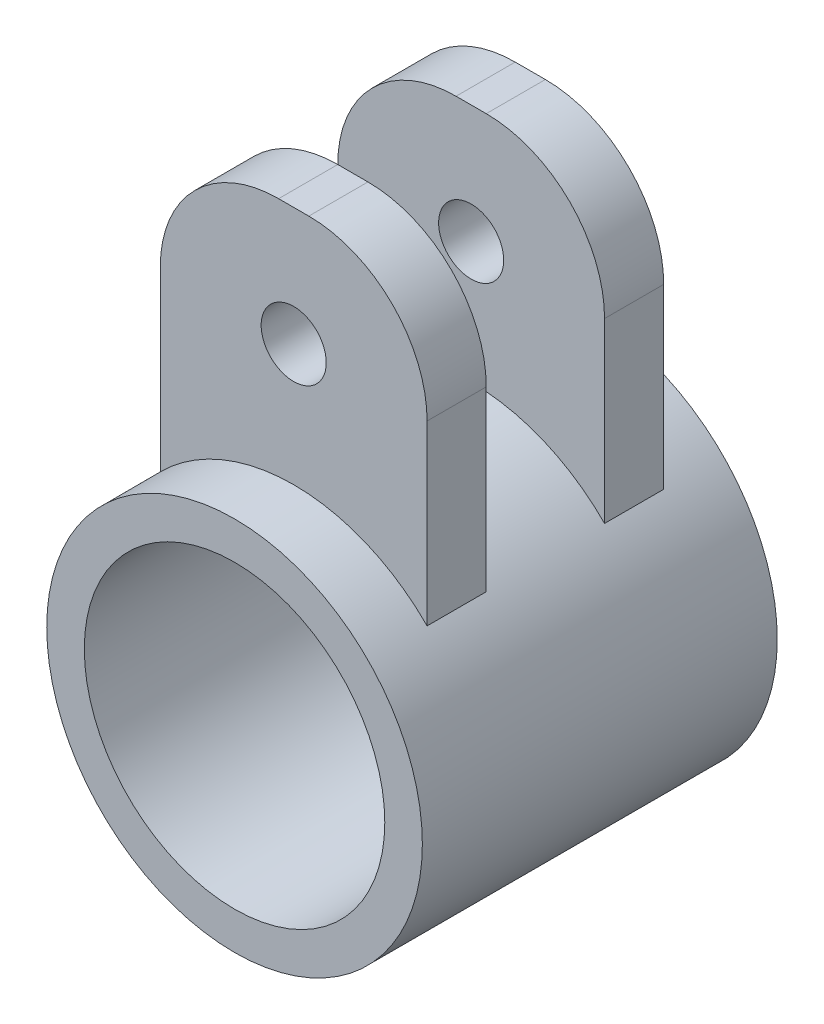
ISO-10303-21;
HEADER;
FILE_DESCRIPTION(('STEP AP214'),'2;1');
FILE_NAME('part.step','',(''),(''),'','','');
FILE_SCHEMA(('AUTOMOTIVE_DESIGN { 1 0 10303 214 1 1 1 1 }'));
ENDSEC;
DATA;
#1=APPLICATION_CONTEXT('core data for automotive mechanical design processes');
#2=APPLICATION_PROTOCOL_DEFINITION('international standard','automotive_design',2000,#1);
#3=PRODUCT_CONTEXT('',#1,'mechanical');
#4=PRODUCT('Part','Part','',(#3));
#5=PRODUCT_RELATED_PRODUCT_CATEGORY('part','',(#4));
#6=PRODUCT_DEFINITION_FORMATION('','',#4);
#7=PRODUCT_DEFINITION_CONTEXT('part definition',#1,'design');
#8=PRODUCT_DEFINITION('design','',#6,#7);
#9=PRODUCT_DEFINITION_SHAPE('','',#8);
#10=(LENGTH_UNIT() NAMED_UNIT(*) SI_UNIT(.MILLI.,.METRE.));
#11=(NAMED_UNIT(*) PLANE_ANGLE_UNIT() SI_UNIT($,.RADIAN.));
#12=(NAMED_UNIT(*) SI_UNIT($,.STERADIAN.) SOLID_ANGLE_UNIT());
#13=UNCERTAINTY_MEASURE_WITH_UNIT(LENGTH_MEASURE(1.E-05),#10,'distance_accuracy_value','');
#14=(GEOMETRIC_REPRESENTATION_CONTEXT(3) GLOBAL_UNCERTAINTY_ASSIGNED_CONTEXT((#13)) GLOBAL_UNIT_ASSIGNED_CONTEXT((#10,
#11,#12)) REPRESENTATION_CONTEXT('',''));
#15=CARTESIAN_POINT('',(0.,0.,0.));
#16=DIRECTION('',(0.,0.,1.));
#17=DIRECTION('',(1.,0.,0.));
#18=AXIS2_PLACEMENT_3D('',#15,#16,#17);
#19=CARTESIAN_POINT('',(11.2764008479815,11.1740059475393,10.));
#20=DIRECTION('',(-1.,0.,0.));
#21=DIRECTION('',(0.,-1.,0.));
#22=AXIS2_PLACEMENT_3D('',#19,#20,#21);
#23=PLANE('',#22);
#24=DIRECTION('',(0.,1.,0.));
#25=VECTOR('',#24,1.);
#26=CARTESIAN_POINT('',(11.2764008479815,11.1740059475393,-5.));
#27=LINE('',#26,#25);
#28=CARTESIAN_POINT('',(11.2764008479815,11.1740059475393,-5.));
#29=VERTEX_POINT('',#28);
#30=CARTESIAN_POINT('',(11.2764008479815,26.1740059475392,-5.));
#31=VERTEX_POINT('',#30);
#32=EDGE_CURVE('E132',#29,#31,#27,.T.);
#33=ORIENTED_EDGE('',*,*,#32,.F.);
#34=DIRECTION('',(0.,0.,-1.));
#35=VECTOR('',#34,1.);
#36=CARTESIAN_POINT('',(11.2764008479815,11.1740059475393,10.));
#37=LINE('',#36,#35);
#38=CARTESIAN_POINT('',(11.2764008479815,11.1740059475393,-10.));
#39=VERTEX_POINT('',#38);
#40=EDGE_CURVE('E144',#29,#39,#37,.T.);
#41=ORIENTED_EDGE('',*,*,#40,.T.);
#42=DIRECTION('',(0.,1.,0.));
#43=VECTOR('',#42,1.);
#44=CARTESIAN_POINT('',(11.2764008479815,11.1740059475393,-10.));
#45=LINE('',#44,#43);
#46=CARTESIAN_POINT('',(11.2764008479815,26.1740059475392,-10.));
#47=VERTEX_POINT('',#46);
#48=EDGE_CURVE('E284',#39,#47,#45,.T.);
#49=ORIENTED_EDGE('',*,*,#48,.T.);
#50=DIRECTION('',(0.,0.,-1.));
#51=VECTOR('',#50,1.);
#52=CARTESIAN_POINT('',(11.2764008479815,26.1740059475392,10.));
#53=LINE('',#52,#51);
#54=EDGE_CURVE('E146',#31,#47,#53,.T.);
#55=ORIENTED_EDGE('',*,*,#54,.F.);
#56=EDGE_LOOP('',(#33,#41,#49,#55));
#57=FACE_BOUND('',#56,.T.);
#58=ADVANCED_FACE('F39',(#57),#23,.F.);
#59=CARTESIAN_POINT('',(1.27640084798146,26.1740059475393,10.));
#60=DIRECTION('',(0.,0.,-1.));
#61=DIRECTION('',(-1.,0.,0.));
#62=AXIS2_PLACEMENT_3D('',#59,#60,#61);
#63=CYLINDRICAL_SURFACE('',#62,10.);
#64=CARTESIAN_POINT('',(1.27640084798146,26.1740059475393,-5.));
#65=DIRECTION('',(0.,0.,1.));
#66=DIRECTION('',(-1.,0.,0.));
#67=AXIS2_PLACEMENT_3D('',#64,#65,#66);
#68=CIRCLE('',#67,10.);
#69=CARTESIAN_POINT('',(1.27640084798139,36.1740059475393,-5.));
#70=VERTEX_POINT('',#69);
#71=EDGE_CURVE('E147',#31,#70,#68,.T.);
#72=ORIENTED_EDGE('',*,*,#71,.F.);
#73=ORIENTED_EDGE('',*,*,#54,.T.);
#74=CARTESIAN_POINT('',(1.27640084798146,26.1740059475393,-10.));
#75=DIRECTION('',(0.,0.,1.));
#76=DIRECTION('',(-1.,0.,0.));
#77=AXIS2_PLACEMENT_3D('',#74,#75,#76);
#78=CIRCLE('',#77,10.);
#79=CARTESIAN_POINT('',(1.27640084798139,36.1740059475393,-10.));
#80=VERTEX_POINT('',#79);
#81=EDGE_CURVE('E286',#47,#80,#78,.T.);
#82=ORIENTED_EDGE('',*,*,#81,.T.);
#83=DIRECTION('',(0.,0.,-1.));
#84=VECTOR('',#83,1.);
#85=CARTESIAN_POINT('',(1.27640084798139,36.1740059475393,10.));
#86=LINE('',#85,#84);
#87=EDGE_CURVE('E307',#70,#80,#86,.T.);
#88=ORIENTED_EDGE('',*,*,#87,.F.);
#89=EDGE_LOOP('',(#72,#73,#82,#88));
#90=FACE_BOUND('',#89,.T.);
#91=ADVANCED_FACE('F188',(#90),#63,.T.);
#92=CARTESIAN_POINT('',(-1.27640084798139,36.1740059475393,10.));
#93=DIRECTION('',(0.,-1.,0.));
#94=DIRECTION('',(0.,0.,-1.));
#95=AXIS2_PLACEMENT_3D('',#92,#93,#94);
#96=PLANE('',#95);
#97=DIRECTION('',(-1.,0.,0.));
#98=VECTOR('',#97,1.);
#99=CARTESIAN_POINT('',(-1.27640084798139,36.1740059475393,-5.));
#100=LINE('',#99,#98);
#101=CARTESIAN_POINT('',(-1.27640084798139,36.1740059475393,-5.));
#102=VERTEX_POINT('',#101);
#103=EDGE_CURVE('E250',#70,#102,#100,.T.);
#104=ORIENTED_EDGE('',*,*,#103,.F.);
#105=ORIENTED_EDGE('',*,*,#87,.T.);
#106=DIRECTION('',(-1.,0.,0.));
#107=VECTOR('',#106,1.);
#108=CARTESIAN_POINT('',(-1.27640084798139,36.1740059475393,-10.));
#109=LINE('',#108,#107);
#110=CARTESIAN_POINT('',(-1.27640084798139,36.1740059475393,-10.));
#111=VERTEX_POINT('',#110);
#112=EDGE_CURVE('E289',#80,#111,#109,.T.);
#113=ORIENTED_EDGE('',*,*,#112,.T.);
#114=DIRECTION('',(0.,0.,-1.));
#115=VECTOR('',#114,1.);
#116=CARTESIAN_POINT('',(-1.27640084798139,36.1740059475393,10.));
#117=LINE('',#116,#115);
#118=EDGE_CURVE('E304',#102,#111,#117,.T.);
#119=ORIENTED_EDGE('',*,*,#118,.F.);
#120=EDGE_LOOP('',(#104,#105,#113,#119));
#121=FACE_BOUND('',#120,.T.);
#122=ADVANCED_FACE('F192',(#121),#96,.F.);
#123=CARTESIAN_POINT('',(-1.27640084798146,26.1740059475393,10.));
#124=DIRECTION('',(0.,0.,-1.));
#125=DIRECTION('',(-1.,0.,0.));
#126=AXIS2_PLACEMENT_3D('',#123,#124,#125);
#127=CYLINDRICAL_SURFACE('',#126,10.);
#128=CARTESIAN_POINT('',(-1.27640084798146,26.1740059475393,-5.));
#129=DIRECTION('',(0.,0.,1.));
#130=DIRECTION('',(-1.,0.,0.));
#131=AXIS2_PLACEMENT_3D('',#128,#129,#130);
#132=CIRCLE('',#131,10.);
#133=CARTESIAN_POINT('',(-11.2764008479815,26.1740059475392,-5.));
#134=VERTEX_POINT('',#133);
#135=EDGE_CURVE('E252',#102,#134,#132,.T.);
#136=ORIENTED_EDGE('',*,*,#135,.F.);
#137=ORIENTED_EDGE('',*,*,#118,.T.);
#138=CARTESIAN_POINT('',(-1.27640084798146,26.1740059475393,-10.));
#139=DIRECTION('',(0.,0.,1.));
#140=DIRECTION('',(-1.,0.,0.));
#141=AXIS2_PLACEMENT_3D('',#138,#139,#140);
#142=CIRCLE('',#141,10.);
#143=CARTESIAN_POINT('',(-11.2764008479815,26.1740059475392,-10.));
#144=VERTEX_POINT('',#143);
#145=EDGE_CURVE('E292',#111,#144,#142,.T.);
#146=ORIENTED_EDGE('',*,*,#145,.T.);
#147=DIRECTION('',(0.,0.,-1.));
#148=VECTOR('',#147,1.);
#149=CARTESIAN_POINT('',(-11.2764008479815,26.1740059475392,10.));
#150=LINE('',#149,#148);
#151=EDGE_CURVE('E300',#134,#144,#150,.T.);
#152=ORIENTED_EDGE('',*,*,#151,.F.);
#153=EDGE_LOOP('',(#136,#137,#146,#152));
#154=FACE_BOUND('',#153,.T.);
#155=ADVANCED_FACE('F207',(#154),#127,.T.);
#156=CARTESIAN_POINT('',(-11.2764008479815,11.1740059475393,10.));
#157=DIRECTION('',(1.,0.,0.));
#158=DIRECTION('',(0.,0.,-1.));
#159=AXIS2_PLACEMENT_3D('',#156,#157,#158);
#160=PLANE('',#159);
#161=DIRECTION('',(0.,-1.,0.));
#162=VECTOR('',#161,1.);
#163=CARTESIAN_POINT('',(-11.2764008479815,11.1740059475393,-5.));
#164=LINE('',#163,#162);
#165=CARTESIAN_POINT('',(-11.2764008479815,11.1740059475393,-5.));
#166=VERTEX_POINT('',#165);
#167=EDGE_CURVE('E135',#134,#166,#164,.T.);
#168=ORIENTED_EDGE('',*,*,#167,.F.);
#169=ORIENTED_EDGE('',*,*,#151,.T.);
#170=DIRECTION('',(0.,-1.,0.));
#171=VECTOR('',#170,1.);
#172=CARTESIAN_POINT('',(-11.2764008479815,11.1740059475393,-10.));
#173=LINE('',#172,#171);
#174=CARTESIAN_POINT('',(-11.2764008479815,11.1740059475393,-10.));
#175=VERTEX_POINT('',#174);
#176=EDGE_CURVE('E271',#144,#175,#173,.T.);
#177=ORIENTED_EDGE('',*,*,#176,.T.);
#178=DIRECTION('',(0.,0.,-1.));
#179=VECTOR('',#178,1.);
#180=CARTESIAN_POINT('',(-11.2764008479815,11.1740059475393,10.));
#181=LINE('',#180,#179);
#182=EDGE_CURVE('E282',#166,#175,#181,.T.);
#183=ORIENTED_EDGE('',*,*,#182,.F.);
#184=EDGE_LOOP('',(#168,#169,#177,#183));
#185=FACE_BOUND('',#184,.T.);
#186=ADVANCED_FACE('F212',(#185),#160,.F.);
#187=CARTESIAN_POINT('',(0.,0.,15.));
#188=DIRECTION('',(0.,0.,1.));
#189=DIRECTION('',(1.,0.,0.));
#190=AXIS2_PLACEMENT_3D('',#187,#188,#189);
#191=PLANE('',#190);
#192=CARTESIAN_POINT('',(0.,0.,15.));
#193=DIRECTION('',(0.,0.,1.));
#194=DIRECTION('',(1.,0.,0.));
#195=AXIS2_PLACEMENT_3D('',#192,#193,#194);
#196=CIRCLE('',#195,15.875);
#197=CARTESIAN_POINT('',(15.875,0.,15.));
#198=VERTEX_POINT('',#197);
#199=EDGE_CURVE('E11',#198,#198,#196,.T.);
#200=ORIENTED_EDGE('',*,*,#199,.T.);
#201=EDGE_LOOP('',(#200));
#202=FACE_BOUND('',#201,.T.);
#203=CARTESIAN_POINT('',(0.,0.,15.));
#204=DIRECTION('',(0.,0.,1.));
#205=DIRECTION('',(1.,0.,0.));
#206=AXIS2_PLACEMENT_3D('',#203,#204,#205);
#207=CIRCLE('',#206,12.7);
#208=CARTESIAN_POINT('',(12.7,0.,15.));
#209=VERTEX_POINT('',#208);
#210=EDGE_CURVE('E160',#209,#209,#207,.T.);
#211=ORIENTED_EDGE('',*,*,#210,.F.);
#212=EDGE_LOOP('',(#211));
#213=FACE_BOUND('',#212,.T.);
#214=ADVANCED_FACE('F171',(#202,#213),#191,.T.);
#215=CARTESIAN_POINT('',(0.,0.,-15.));
#216=DIRECTION('',(0.,0.,1.));
#217=DIRECTION('',(1.,0.,0.));
#218=AXIS2_PLACEMENT_3D('',#215,#216,#217);
#219=PLANE('',#218);
#220=CARTESIAN_POINT('',(0.,0.,-15.));
#221=DIRECTION('',(0.,0.,1.));
#222=DIRECTION('',(1.,0.,0.));
#223=AXIS2_PLACEMENT_3D('',#220,#221,#222);
#224=CIRCLE('',#223,15.875);
#225=CARTESIAN_POINT('',(15.875,0.,-15.));
#226=VERTEX_POINT('',#225);
#227=EDGE_CURVE('E48',#226,#226,#224,.T.);
#228=ORIENTED_EDGE('',*,*,#227,.F.);
#229=EDGE_LOOP('',(#228));
#230=FACE_BOUND('',#229,.T.);
#231=CARTESIAN_POINT('',(0.,0.,-15.));
#232=DIRECTION('',(0.,0.,1.));
#233=DIRECTION('',(1.,0.,0.));
#234=AXIS2_PLACEMENT_3D('',#231,#232,#233);
#235=CIRCLE('',#234,12.7);
#236=CARTESIAN_POINT('',(12.7,0.,-15.));
#237=VERTEX_POINT('',#236);
#238=EDGE_CURVE('E155',#237,#237,#235,.T.);
#239=ORIENTED_EDGE('',*,*,#238,.T.);
#240=EDGE_LOOP('',(#239));
#241=FACE_BOUND('',#240,.T.);
#242=ADVANCED_FACE('F168',(#230,#241),#219,.F.);
#243=CARTESIAN_POINT('',(0.,0.,15.));
#244=DIRECTION('',(0.,0.,-1.));
#245=DIRECTION('',(-1.,0.,0.));
#246=AXIS2_PLACEMENT_3D('',#243,#244,#245);
#247=CYLINDRICAL_SURFACE('',#246,15.875);
#248=CARTESIAN_POINT('',(0.,0.,5.));
#249=DIRECTION('',(0.,0.,-1.));
#250=DIRECTION('',(1.,0.,0.));
#251=AXIS2_PLACEMENT_3D('',#248,#249,#250);
#252=CIRCLE('',#251,15.875);
#253=CARTESIAN_POINT('',(-11.2764008479815,11.1740059475393,5.));
#254=VERTEX_POINT('',#253);
#255=CARTESIAN_POINT('',(11.2764008479815,11.1740059475393,5.));
#256=VERTEX_POINT('',#255);
#257=EDGE_CURVE('E56',#254,#256,#252,.T.);
#258=ORIENTED_EDGE('',*,*,#257,.T.);
#259=CARTESIAN_POINT('',(11.2764008479815,11.1740059475393,10.));
#260=VERTEX_POINT('',#259);
#261=EDGE_CURVE('E63',#260,#256,#37,.T.);
#262=ORIENTED_EDGE('',*,*,#261,.F.);
#263=CARTESIAN_POINT('',(0.,0.,10.));
#264=DIRECTION('',(0.,0.,-1.));
#265=DIRECTION('',(1.,0.,0.));
#266=AXIS2_PLACEMENT_3D('',#263,#264,#265);
#267=CIRCLE('',#266,15.875);
#268=CARTESIAN_POINT('',(-11.2764008479815,11.1740059475393,10.));
#269=VERTEX_POINT('',#268);
#270=EDGE_CURVE('E267',#269,#260,#267,.T.);
#271=ORIENTED_EDGE('',*,*,#270,.F.);
#272=EDGE_CURVE('E297',#269,#254,#181,.T.);
#273=ORIENTED_EDGE('',*,*,#272,.T.);
#274=EDGE_LOOP('',(#258,#262,#271,#273));
#275=FACE_BOUND('',#274,.T.);
#276=ORIENTED_EDGE('',*,*,#40,.F.);
#277=CARTESIAN_POINT('',(0.,0.,-5.));
#278=DIRECTION('',(0.,0.,-1.));
#279=DIRECTION('',(1.,0.,0.));
#280=AXIS2_PLACEMENT_3D('',#277,#278,#279);
#281=CIRCLE('',#280,15.875);
#282=EDGE_CURVE('E129',#166,#29,#281,.T.);
#283=ORIENTED_EDGE('',*,*,#282,.F.);
#284=ORIENTED_EDGE('',*,*,#182,.T.);
#285=CARTESIAN_POINT('',(0.,0.,-10.));
#286=DIRECTION('',(0.,0.,-1.));
#287=DIRECTION('',(1.,0.,0.));
#288=AXIS2_PLACEMENT_3D('',#285,#286,#287);
#289=CIRCLE('',#288,15.875);
#290=EDGE_CURVE('E151',#175,#39,#289,.T.);
#291=ORIENTED_EDGE('',*,*,#290,.T.);
#292=EDGE_LOOP('',(#276,#283,#284,#291));
#293=FACE_BOUND('',#292,.T.);
#294=ORIENTED_EDGE('',*,*,#199,.F.);
#295=EDGE_LOOP('',(#294));
#296=FACE_BOUND('',#295,.T.);
#297=ORIENTED_EDGE('',*,*,#227,.T.);
#298=EDGE_LOOP('',(#297));
#299=FACE_BOUND('',#298,.T.);
#300=ADVANCED_FACE('F41',(#275,#293,#296,#299),#247,.T.);
#301=CARTESIAN_POINT('',(0.,0.,15.));
#302=DIRECTION('',(0.,0.,-1.));
#303=DIRECTION('',(-1.,0.,0.));
#304=AXIS2_PLACEMENT_3D('',#301,#302,#303);
#305=CYLINDRICAL_SURFACE('',#304,12.7);
#306=ORIENTED_EDGE('',*,*,#210,.T.);
#307=EDGE_LOOP('',(#306));
#308=FACE_BOUND('',#307,.T.);
#309=ORIENTED_EDGE('',*,*,#238,.F.);
#310=EDGE_LOOP('',(#309));
#311=FACE_BOUND('',#310,.T.);
#312=ADVANCED_FACE('F174',(#308,#311),#305,.F.);
#313=ORIENTED_EDGE('',*,*,#261,.T.);
#314=DIRECTION('',(0.,1.,0.));
#315=VECTOR('',#314,1.);
#316=CARTESIAN_POINT('',(11.2764008479815,11.1740059475393,5.));
#317=LINE('',#316,#315);
#318=CARTESIAN_POINT('',(11.2764008479815,26.1740059475392,5.));
#319=VERTEX_POINT('',#318);
#320=EDGE_CURVE('E243',#256,#319,#317,.T.);
#321=ORIENTED_EDGE('',*,*,#320,.T.);
#322=CARTESIAN_POINT('',(11.2764008479815,26.1740059475392,10.));
#323=VERTEX_POINT('',#322);
#324=EDGE_CURVE('E153',#323,#319,#53,.T.);
#325=ORIENTED_EDGE('',*,*,#324,.F.);
#326=DIRECTION('',(0.,1.,0.));
#327=VECTOR('',#326,1.);
#328=CARTESIAN_POINT('',(11.2764008479815,11.1740059475393,10.));
#329=LINE('',#328,#327);
#330=EDGE_CURVE('E270',#260,#323,#329,.T.);
#331=ORIENTED_EDGE('',*,*,#330,.F.);
#332=EDGE_LOOP('',(#313,#321,#325,#331));
#333=FACE_BOUND('',#332,.T.);
#334=ADVANCED_FACE('F176',(#333),#23,.F.);
#335=ORIENTED_EDGE('',*,*,#324,.T.);
#336=CARTESIAN_POINT('',(1.27640084798146,26.1740059475393,5.));
#337=DIRECTION('',(0.,0.,1.));
#338=DIRECTION('',(-1.,0.,0.));
#339=AXIS2_PLACEMENT_3D('',#336,#337,#338);
#340=CIRCLE('',#339,10.);
#341=CARTESIAN_POINT('',(1.27640084798139,36.1740059475393,5.));
#342=VERTEX_POINT('',#341);
#343=EDGE_CURVE('E257',#319,#342,#340,.T.);
#344=ORIENTED_EDGE('',*,*,#343,.T.);
#345=CARTESIAN_POINT('',(1.27640084798139,36.1740059475393,10.));
#346=VERTEX_POINT('',#345);
#347=EDGE_CURVE('E308',#346,#342,#86,.T.);
#348=ORIENTED_EDGE('',*,*,#347,.F.);
#349=CARTESIAN_POINT('',(1.27640084798146,26.1740059475393,10.));
#350=DIRECTION('',(0.,0.,1.));
#351=DIRECTION('',(-1.,0.,0.));
#352=AXIS2_PLACEMENT_3D('',#349,#350,#351);
#353=CIRCLE('',#352,10.);
#354=EDGE_CURVE('E273',#323,#346,#353,.T.);
#355=ORIENTED_EDGE('',*,*,#354,.F.);
#356=EDGE_LOOP('',(#335,#344,#348,#355));
#357=FACE_BOUND('',#356,.T.);
#358=ADVANCED_FACE('F183',(#357),#63,.T.);
#359=ORIENTED_EDGE('',*,*,#347,.T.);
#360=DIRECTION('',(-1.,0.,0.));
#361=VECTOR('',#360,1.);
#362=CARTESIAN_POINT('',(-1.27640084798139,36.1740059475393,5.));
#363=LINE('',#362,#361);
#364=CARTESIAN_POINT('',(-1.27640084798139,36.1740059475393,5.));
#365=VERTEX_POINT('',#364);
#366=EDGE_CURVE('E260',#342,#365,#363,.T.);
#367=ORIENTED_EDGE('',*,*,#366,.T.);
#368=CARTESIAN_POINT('',(-1.27640084798139,36.1740059475393,10.));
#369=VERTEX_POINT('',#368);
#370=EDGE_CURVE('E305',#369,#365,#117,.T.);
#371=ORIENTED_EDGE('',*,*,#370,.F.);
#372=DIRECTION('',(-1.,0.,0.));
#373=VECTOR('',#372,1.);
#374=CARTESIAN_POINT('',(-1.27640084798139,36.1740059475393,10.));
#375=LINE('',#374,#373);
#376=EDGE_CURVE('E275',#346,#369,#375,.T.);
#377=ORIENTED_EDGE('',*,*,#376,.F.);
#378=EDGE_LOOP('',(#359,#367,#371,#377));
#379=FACE_BOUND('',#378,.T.);
#380=ADVANCED_FACE('F197',(#379),#96,.F.);
#381=ORIENTED_EDGE('',*,*,#370,.T.);
#382=CARTESIAN_POINT('',(-1.27640084798146,26.1740059475393,5.));
#383=DIRECTION('',(0.,0.,1.));
#384=DIRECTION('',(-1.,0.,0.));
#385=AXIS2_PLACEMENT_3D('',#382,#383,#384);
#386=CIRCLE('',#385,10.);
#387=CARTESIAN_POINT('',(-11.2764008479815,26.1740059475392,5.));
#388=VERTEX_POINT('',#387);
#389=EDGE_CURVE('E263',#365,#388,#386,.T.);
#390=ORIENTED_EDGE('',*,*,#389,.T.);
#391=CARTESIAN_POINT('',(-11.2764008479815,26.1740059475392,10.));
#392=VERTEX_POINT('',#391);
#393=EDGE_CURVE('E301',#392,#388,#150,.T.);
#394=ORIENTED_EDGE('',*,*,#393,.F.);
#395=CARTESIAN_POINT('',(-1.27640084798146,26.1740059475393,10.));
#396=DIRECTION('',(0.,0.,1.));
#397=DIRECTION('',(-1.,0.,0.));
#398=AXIS2_PLACEMENT_3D('',#395,#396,#397);
#399=CIRCLE('',#398,10.);
#400=EDGE_CURVE('E277',#369,#392,#399,.T.);
#401=ORIENTED_EDGE('',*,*,#400,.F.);
#402=EDGE_LOOP('',(#381,#390,#394,#401));
#403=FACE_BOUND('',#402,.T.);
#404=ADVANCED_FACE('F201',(#403),#127,.T.);
#405=ORIENTED_EDGE('',*,*,#393,.T.);
#406=DIRECTION('',(0.,-1.,0.));
#407=VECTOR('',#406,1.);
#408=CARTESIAN_POINT('',(-11.2764008479815,11.1740059475393,5.));
#409=LINE('',#408,#407);
#410=EDGE_CURVE('E139',#388,#254,#409,.T.);
#411=ORIENTED_EDGE('',*,*,#410,.T.);
#412=ORIENTED_EDGE('',*,*,#272,.F.);
#413=DIRECTION('',(0.,-1.,0.));
#414=VECTOR('',#413,1.);
#415=CARTESIAN_POINT('',(-11.2764008479815,11.1740059475393,10.));
#416=LINE('',#415,#414);
#417=EDGE_CURVE('E279',#392,#269,#416,.T.);
#418=ORIENTED_EDGE('',*,*,#417,.F.);
#419=EDGE_LOOP('',(#405,#411,#412,#418));
#420=FACE_BOUND('',#419,.T.);
#421=ADVANCED_FACE('F205',(#420),#160,.F.);
#422=CARTESIAN_POINT('',(0.,0.,10.));
#423=DIRECTION('',(0.,0.,1.));
#424=DIRECTION('',(1.,0.,0.));
#425=AXIS2_PLACEMENT_3D('',#422,#423,#424);
#426=PLANE('',#425);
#427=CARTESIAN_POINT('',(0.,26.1740059475393,10.));
#428=DIRECTION('',(0.,0.,1.));
#429=DIRECTION('',(1.,0.,0.));
#430=AXIS2_PLACEMENT_3D('',#427,#428,#429);
#431=CIRCLE('',#430,2.74999999999999);
#432=CARTESIAN_POINT('',(2.74999999999999,26.1740059475393,10.));
#433=VERTEX_POINT('',#432);
#434=EDGE_CURVE('E498',#433,#433,#431,.T.);
#435=ORIENTED_EDGE('',*,*,#434,.F.);
#436=EDGE_LOOP('',(#435));
#437=FACE_BOUND('',#436,.T.);
#438=ORIENTED_EDGE('',*,*,#270,.T.);
#439=ORIENTED_EDGE('',*,*,#330,.T.);
#440=ORIENTED_EDGE('',*,*,#354,.T.);
#441=ORIENTED_EDGE('',*,*,#376,.T.);
#442=ORIENTED_EDGE('',*,*,#400,.T.);
#443=ORIENTED_EDGE('',*,*,#417,.T.);
#444=EDGE_LOOP('',(#438,#439,#440,#441,#442,#443));
#445=FACE_BOUND('',#444,.T.);
#446=ADVANCED_FACE('F210',(#437,#445),#426,.T.);
#447=CARTESIAN_POINT('',(0.,0.,-10.));
#448=DIRECTION('',(0.,0.,1.));
#449=DIRECTION('',(1.,0.,0.));
#450=AXIS2_PLACEMENT_3D('',#447,#448,#449);
#451=PLANE('',#450);
#452=CARTESIAN_POINT('',(0.,26.1740059475393,-10.));
#453=DIRECTION('',(0.,0.,1.));
#454=DIRECTION('',(1.,0.,0.));
#455=AXIS2_PLACEMENT_3D('',#452,#453,#454);
#456=CIRCLE('',#455,2.74999999999999);
#457=CARTESIAN_POINT('',(2.74999999999999,26.1740059475393,-10.));
#458=VERTEX_POINT('',#457);
#459=EDGE_CURVE('E240',#458,#458,#456,.T.);
#460=ORIENTED_EDGE('',*,*,#459,.T.);
#461=EDGE_LOOP('',(#460));
#462=FACE_BOUND('',#461,.T.);
#463=ORIENTED_EDGE('',*,*,#290,.F.);
#464=ORIENTED_EDGE('',*,*,#176,.F.);
#465=ORIENTED_EDGE('',*,*,#145,.F.);
#466=ORIENTED_EDGE('',*,*,#112,.F.);
#467=ORIENTED_EDGE('',*,*,#81,.F.);
#468=ORIENTED_EDGE('',*,*,#48,.F.);
#469=EDGE_LOOP('',(#463,#464,#465,#466,#467,#468));
#470=FACE_BOUND('',#469,.T.);
#471=ADVANCED_FACE('F213',(#462,#470),#451,.F.);
#472=CARTESIAN_POINT('',(0.,0.,-5.));
#473=DIRECTION('',(0.,0.,1.));
#474=DIRECTION('',(1.,0.,0.));
#475=AXIS2_PLACEMENT_3D('',#472,#473,#474);
#476=PLANE('',#475);
#477=CARTESIAN_POINT('',(0.,26.1740059475393,-5.));
#478=DIRECTION('',(0.,0.,1.));
#479=DIRECTION('',(1.,0.,0.));
#480=AXIS2_PLACEMENT_3D('',#477,#478,#479);
#481=CIRCLE('',#480,2.74999999999999);
#482=CARTESIAN_POINT('',(2.74999999999999,26.1740059475393,-5.));
#483=VERTEX_POINT('',#482);
#484=EDGE_CURVE('E43',#483,#483,#481,.T.);
#485=ORIENTED_EDGE('',*,*,#484,.F.);
#486=EDGE_LOOP('',(#485));
#487=FACE_BOUND('',#486,.T.);
#488=ORIENTED_EDGE('',*,*,#282,.T.);
#489=ORIENTED_EDGE('',*,*,#32,.T.);
#490=ORIENTED_EDGE('',*,*,#71,.T.);
#491=ORIENTED_EDGE('',*,*,#103,.T.);
#492=ORIENTED_EDGE('',*,*,#135,.T.);
#493=ORIENTED_EDGE('',*,*,#167,.T.);
#494=EDGE_LOOP('',(#488,#489,#490,#491,#492,#493));
#495=FACE_BOUND('',#494,.T.);
#496=ADVANCED_FACE('F131',(#487,#495),#476,.T.);
#497=CARTESIAN_POINT('',(0.,0.,5.));
#498=DIRECTION('',(0.,0.,1.));
#499=DIRECTION('',(1.,0.,0.));
#500=AXIS2_PLACEMENT_3D('',#497,#498,#499);
#501=PLANE('',#500);
#502=CARTESIAN_POINT('',(0.,26.1740059475393,5.));
#503=DIRECTION('',(0.,0.,1.));
#504=DIRECTION('',(1.,0.,0.));
#505=AXIS2_PLACEMENT_3D('',#502,#503,#504);
#506=CIRCLE('',#505,2.74999999999999);
#507=CARTESIAN_POINT('',(2.74999999999999,26.1740059475393,5.));
#508=VERTEX_POINT('',#507);
#509=EDGE_CURVE('E241',#508,#508,#506,.T.);
#510=ORIENTED_EDGE('',*,*,#509,.T.);
#511=EDGE_LOOP('',(#510));
#512=FACE_BOUND('',#511,.T.);
#513=ORIENTED_EDGE('',*,*,#257,.F.);
#514=ORIENTED_EDGE('',*,*,#410,.F.);
#515=ORIENTED_EDGE('',*,*,#389,.F.);
#516=ORIENTED_EDGE('',*,*,#366,.F.);
#517=ORIENTED_EDGE('',*,*,#343,.F.);
#518=ORIENTED_EDGE('',*,*,#320,.F.);
#519=EDGE_LOOP('',(#513,#514,#515,#516,#517,#518));
#520=FACE_BOUND('',#519,.T.);
#521=ADVANCED_FACE('F220',(#512,#520),#501,.F.);
#522=CARTESIAN_POINT('',(0.,26.1740059475393,10.));
#523=DIRECTION('',(0.,0.,1.));
#524=DIRECTION('',(1.,0.,0.));
#525=AXIS2_PLACEMENT_3D('',#522,#523,#524);
#526=CYLINDRICAL_SURFACE('',#525,2.74999999999999);
#527=ORIENTED_EDGE('',*,*,#484,.T.);
#528=EDGE_LOOP('',(#527));
#529=FACE_BOUND('',#528,.T.);
#530=ORIENTED_EDGE('',*,*,#459,.F.);
#531=EDGE_LOOP('',(#530));
#532=FACE_BOUND('',#531,.T.);
#533=ADVANCED_FACE('F223',(#529,#532),#526,.F.);
#534=ORIENTED_EDGE('',*,*,#434,.T.);
#535=EDGE_LOOP('',(#534));
#536=FACE_BOUND('',#535,.T.);
#537=ORIENTED_EDGE('',*,*,#509,.F.);
#538=EDGE_LOOP('',(#537));
#539=FACE_BOUND('',#538,.T.);
#540=ADVANCED_FACE('F229',(#536,#539),#526,.F.);
#541=CLOSED_SHELL('',(#58,#91,#122,#155,#186,#214,#242,#300,#312,#334,#358,#380,#404,#421,#446,
#471,#496,#521,#533,#540));
#542=MANIFOLD_SOLID_BREP('B2',#541);
#543=ADVANCED_BREP_SHAPE_REPRESENTATION('',(#18,#542),#14);
#544=SHAPE_DEFINITION_REPRESENTATION(#9,#543);
ENDSEC;
END-ISO-10303-21;
